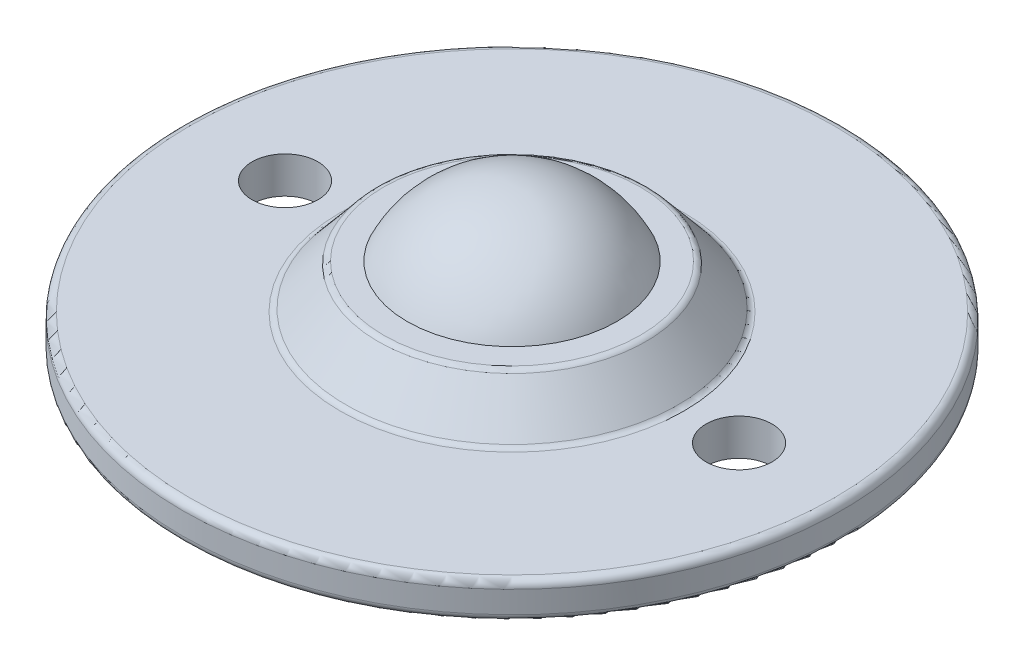
ISO-10303-21;
HEADER;
FILE_DESCRIPTION(('STEP AP214'),'2;1');
FILE_NAME('part.step','',(''),(''),'','','');
FILE_SCHEMA(('AUTOMOTIVE_DESIGN { 1 0 10303 214 1 1 1 1 }'));
ENDSEC;
DATA;
#1=APPLICATION_CONTEXT('core data for automotive mechanical design processes');
#2=APPLICATION_PROTOCOL_DEFINITION('international standard','automotive_design',2000,#1);
#3=PRODUCT_CONTEXT('',#1,'mechanical');
#4=PRODUCT('Part','Part','',(#3));
#5=PRODUCT_RELATED_PRODUCT_CATEGORY('part','',(#4));
#6=PRODUCT_DEFINITION_FORMATION('','',#4);
#7=PRODUCT_DEFINITION_CONTEXT('part definition',#1,'design');
#8=PRODUCT_DEFINITION('design','',#6,#7);
#9=PRODUCT_DEFINITION_SHAPE('','',#8);
#10=(LENGTH_UNIT() NAMED_UNIT(*) SI_UNIT(.MILLI.,.METRE.));
#11=(NAMED_UNIT(*) PLANE_ANGLE_UNIT() SI_UNIT($,.RADIAN.));
#12=(NAMED_UNIT(*) SI_UNIT($,.STERADIAN.) SOLID_ANGLE_UNIT());
#13=UNCERTAINTY_MEASURE_WITH_UNIT(LENGTH_MEASURE(1.E-05),#10,'distance_accuracy_value','');
#14=(GEOMETRIC_REPRESENTATION_CONTEXT(3) GLOBAL_UNCERTAINTY_ASSIGNED_CONTEXT((#13)) GLOBAL_UNIT_ASSIGNED_CONTEXT((#10,
#11,#12)) REPRESENTATION_CONTEXT('',''));
#15=CARTESIAN_POINT('',(0.,0.,0.));
#16=DIRECTION('',(0.,0.,1.));
#17=DIRECTION('',(1.,0.,0.));
#18=AXIS2_PLACEMENT_3D('',#15,#16,#17);
#19=CARTESIAN_POINT('',(0.,-1.00613961606655E-13,0.));
#20=DIRECTION('',(0.,1.,0.));
#21=DIRECTION('',(0.,0.,-1.));
#22=AXIS2_PLACEMENT_3D('',#19,#20,#21);
#23=SPHERICAL_SURFACE('',#22,7.93750000000009);
#24=CARTESIAN_POINT('',(0.,3.43750000000002,0.));
#25=DIRECTION('',(0.,1.,0.));
#26=DIRECTION('',(0.,0.,1.));
#27=AXIS2_PLACEMENT_3D('',#24,#25,#26);
#28=CIRCLE('',#27,7.15454401062705);
#29=CARTESIAN_POINT('',(0.,3.43750000000004,7.15454401062701));
#30=VERTEX_POINT('',#29);
#31=EDGE_CURVE('E63',#30,#30,#28,.T.);
#32=ORIENTED_EDGE('',*,*,#31,.T.);
#33=EDGE_LOOP('',(#32));
#34=FACE_BOUND('',#33,.T.);
#35=ADVANCED_FACE('F31',(#34),#23,.T.);
#36=CARTESIAN_POINT('',(0.,3.4375,-7.15454401062709));
#37=DIRECTION('',(0.,-1.,0.));
#38=DIRECTION('',(0.,0.,-1.));
#39=AXIS2_PLACEMENT_3D('',#36,#37,#38);
#40=PLANE('',#39);
#41=CARTESIAN_POINT('',(0.,3.43750000000002,0.));
#42=DIRECTION('',(0.,-1.,0.));
#43=DIRECTION('',(0.,0.,-1.));
#44=AXIS2_PLACEMENT_3D('',#41,#42,#43);
#45=CIRCLE('',#44,8.76581252700774);
#46=CARTESIAN_POINT('',(0.,3.4375,-8.76581252700778));
#47=VERTEX_POINT('',#46);
#48=EDGE_CURVE('E60',#47,#47,#45,.F.);
#49=ORIENTED_EDGE('',*,*,#48,.T.);
#50=EDGE_LOOP('',(#49));
#51=FACE_BOUND('',#50,.T.);
#52=ORIENTED_EDGE('',*,*,#31,.F.);
#53=EDGE_LOOP('',(#52));
#54=FACE_BOUND('',#53,.T.);
#55=ADVANCED_FACE('F121',(#51,#54),#40,.F.);
#56=CARTESIAN_POINT('',(0.,0.437500000000029,0.));
#57=DIRECTION('',(0.,-1.,0.));
#58=DIRECTION('',(0.,0.,-1.));
#59=AXIS2_PLACEMENT_3D('',#56,#57,#58);
#60=CONICAL_SURFACE('',#59,11.5,0.694738276196706);
#61=CARTESIAN_POINT('',(0.,3.25759219983226,0.));
#62=DIRECTION('',(0.,1.,0.));
#63=DIRECTION('',(0.,0.,1.));
#64=AXIS2_PLACEMENT_3D('',#61,#62,#63);
#65=CIRCLE('',#64,9.14992316680643);
#66=CARTESIAN_POINT('',(0.,3.25759219983229,9.14992316680638));
#67=VERTEX_POINT('',#66);
#68=EDGE_CURVE('E54',#67,#67,#65,.F.);
#69=ORIENTED_EDGE('',*,*,#68,.T.);
#70=EDGE_LOOP('',(#69));
#71=FACE_BOUND('',#70,.T.);
#72=CARTESIAN_POINT('',(0.,0.617407800167804,0.));
#73=DIRECTION('',(0.,-1.,0.));
#74=DIRECTION('',(0.,0.,-1.));
#75=AXIS2_PLACEMENT_3D('',#72,#73,#74);
#76=CIRCLE('',#75,11.3500768331935);
#77=CARTESIAN_POINT('',(0.,0.617407800167774,-11.3500768331935));
#78=VERTEX_POINT('',#77);
#79=EDGE_CURVE('E57',#78,#78,#76,.F.);
#80=ORIENTED_EDGE('',*,*,#79,.T.);
#81=EDGE_LOOP('',(#80));
#82=FACE_BOUND('',#81,.T.);
#83=ADVANCED_FACE('F92',(#71,#82),#60,.T.);
#84=CARTESIAN_POINT('',(0.,0.437499999999985,-22.5));
#85=DIRECTION('',(0.,-1.,0.));
#86=DIRECTION('',(0.,0.,-1.));
#87=AXIS2_PLACEMENT_3D('',#84,#85,#86);
#88=PLANE('',#87);
#89=CARTESIAN_POINT('',(0.,0.437500000000044,0.));
#90=DIRECTION('',(0.,-1.,0.));
#91=DIRECTION('',(0.,0.,-1.));
#92=AXIS2_PLACEMENT_3D('',#89,#90,#91);
#93=CIRCLE('',#92,11.7341874729922);
#94=CARTESIAN_POINT('',(0.,0.437500000000013,-11.7341874729922));
#95=VERTEX_POINT('',#94);
#96=EDGE_CURVE('E46',#95,#95,#93,.T.);
#97=ORIENTED_EDGE('',*,*,#96,.T.);
#98=EDGE_LOOP('',(#97));
#99=FACE_BOUND('',#98,.T.);
#100=CARTESIAN_POINT('',(0.,0.437500000000044,0.));
#101=DIRECTION('',(0.,-1.,0.));
#102=DIRECTION('',(0.,0.,-1.));
#103=AXIS2_PLACEMENT_3D('',#100,#101,#102);
#104=CIRCLE('',#103,22.);
#105=CARTESIAN_POINT('',(0.,0.437499999999986,-22.));
#106=VERTEX_POINT('',#105);
#107=EDGE_CURVE('E51',#106,#106,#104,.F.);
#108=ORIENTED_EDGE('',*,*,#107,.T.);
#109=EDGE_LOOP('',(#108));
#110=FACE_BOUND('',#109,.T.);
#111=CARTESIAN_POINT('',(-15.5,0.437500000000044,0.));
#112=DIRECTION('',(0.,1.,0.));
#113=DIRECTION('',(0.,0.,1.));
#114=AXIS2_PLACEMENT_3D('',#111,#112,#113);
#115=CIRCLE('',#114,2.25);
#116=CARTESIAN_POINT('',(-15.5,0.43750000000005,2.25));
#117=VERTEX_POINT('',#116);
#118=EDGE_CURVE('E71',#117,#117,#115,.T.);
#119=ORIENTED_EDGE('',*,*,#118,.F.);
#120=EDGE_LOOP('',(#119));
#121=FACE_BOUND('',#120,.T.);
#122=CARTESIAN_POINT('',(15.5,0.437500000000044,0.));
#123=DIRECTION('',(0.,1.,0.));
#124=DIRECTION('',(0.,0.,1.));
#125=AXIS2_PLACEMENT_3D('',#122,#123,#124);
#126=CIRCLE('',#125,2.25);
#127=CARTESIAN_POINT('',(15.5,0.43750000000005,2.25));
#128=VERTEX_POINT('',#127);
#129=EDGE_CURVE('E79',#128,#128,#126,.T.);
#130=ORIENTED_EDGE('',*,*,#129,.F.);
#131=EDGE_LOOP('',(#130));
#132=FACE_BOUND('',#131,.T.);
#133=ADVANCED_FACE('F88',(#99,#110,#121,#132),#88,.F.);
#134=CARTESIAN_POINT('',(0.,7.93749999999999,0.));
#135=DIRECTION('',(0.,1.,0.));
#136=DIRECTION('',(0.,0.,1.));
#137=AXIS2_PLACEMENT_3D('',#134,#135,#136);
#138=CYLINDRICAL_SURFACE('',#137,22.5);
#139=CARTESIAN_POINT('',(0.,-1.56249999999995,0.));
#140=DIRECTION('',(0.,1.,0.));
#141=DIRECTION('',(0.,0.,1.));
#142=AXIS2_PLACEMENT_3D('',#139,#140,#141);
#143=CIRCLE('',#142,22.5);
#144=CARTESIAN_POINT('',(0.,-1.56249999999989,22.4999999999999));
#145=VERTEX_POINT('',#144);
#146=EDGE_CURVE('E38',#145,#145,#143,.T.);
#147=ORIENTED_EDGE('',*,*,#146,.T.);
#148=EDGE_LOOP('',(#147));
#149=FACE_BOUND('',#148,.T.);
#150=CARTESIAN_POINT('',(0.,-0.0624999999999567,0.));
#151=DIRECTION('',(0.,-1.,0.));
#152=DIRECTION('',(0.,0.,-1.));
#153=AXIS2_PLACEMENT_3D('',#150,#151,#152);
#154=CIRCLE('',#153,22.5);
#155=CARTESIAN_POINT('',(0.,-0.0625000000000162,-22.5));
#156=VERTEX_POINT('',#155);
#157=EDGE_CURVE('E42',#156,#156,#154,.T.);
#158=ORIENTED_EDGE('',*,*,#157,.T.);
#159=EDGE_LOOP('',(#158));
#160=FACE_BOUND('',#159,.T.);
#161=ADVANCED_FACE('F91',(#149,#160),#138,.T.);
#162=CARTESIAN_POINT('',(0.,-2.06249999999999,-13.));
#163=DIRECTION('',(0.,1.,0.));
#164=DIRECTION('',(0.,0.,1.));
#165=AXIS2_PLACEMENT_3D('',#162,#163,#164);
#166=PLANE('',#165);
#167=CARTESIAN_POINT('',(0.,-2.06249999999995,0.));
#168=DIRECTION('',(0.,1.,0.));
#169=DIRECTION('',(0.,0.,1.));
#170=AXIS2_PLACEMENT_3D('',#167,#168,#169);
#171=CIRCLE('',#170,22.);
#172=CARTESIAN_POINT('',(0.,-2.0624999999999,21.9999999999999));
#173=VERTEX_POINT('',#172);
#174=EDGE_CURVE('E10',#173,#173,#171,.F.);
#175=ORIENTED_EDGE('',*,*,#174,.T.);
#176=EDGE_LOOP('',(#175));
#177=FACE_BOUND('',#176,.T.);
#178=CARTESIAN_POINT('',(-15.5,-2.06249999999995,0.));
#179=DIRECTION('',(0.,1.,0.));
#180=DIRECTION('',(0.,0.,1.));
#181=AXIS2_PLACEMENT_3D('',#178,#179,#180);
#182=CIRCLE('',#181,2.25);
#183=CARTESIAN_POINT('',(-15.5,-2.06249999999995,2.25000000000001));
#184=VERTEX_POINT('',#183);
#185=EDGE_CURVE('E64',#184,#184,#182,.T.);
#186=ORIENTED_EDGE('',*,*,#185,.T.);
#187=EDGE_LOOP('',(#186));
#188=FACE_BOUND('',#187,.T.);
#189=CARTESIAN_POINT('',(15.5,-2.06249999999995,0.));
#190=DIRECTION('',(0.,1.,0.));
#191=DIRECTION('',(0.,0.,1.));
#192=AXIS2_PLACEMENT_3D('',#189,#190,#191);
#193=CIRCLE('',#192,2.25);
#194=CARTESIAN_POINT('',(15.5,-2.06249999999995,2.25));
#195=VERTEX_POINT('',#194);
#196=EDGE_CURVE('E68',#195,#195,#193,.T.);
#197=ORIENTED_EDGE('',*,*,#196,.T.);
#198=EDGE_LOOP('',(#197));
#199=FACE_BOUND('',#198,.T.);
#200=CARTESIAN_POINT('',(0.,-2.06249999999997,0.));
#201=DIRECTION('',(0.,1.,0.));
#202=DIRECTION('',(0.,0.,1.));
#203=AXIS2_PLACEMENT_3D('',#200,#201,#202);
#204=CIRCLE('',#203,13.);
#205=CARTESIAN_POINT('',(0.,-2.06249999999993,12.9999999999999));
#206=VERTEX_POINT('',#205);
#207=EDGE_CURVE('E74',#206,#206,#204,.T.);
#208=ORIENTED_EDGE('',*,*,#207,.T.);
#209=EDGE_LOOP('',(#208));
#210=FACE_BOUND('',#209,.T.);
#211=ADVANCED_FACE('F104',(#177,#188,#199,#210),#166,.F.);
#212=CARTESIAN_POINT('',(0.,-4.88888888888886,0.));
#213=DIRECTION('',(0.,1.,0.));
#214=DIRECTION('',(0.,0.,1.));
#215=AXIS2_PLACEMENT_3D('',#212,#213,#214);
#216=TOROIDAL_SURFACE('',#215,13.,2.82638888888889);
#217=ORIENTED_EDGE('',*,*,#207,.F.);
#218=EDGE_LOOP('',(#217));
#219=FACE_BOUND('',#218,.T.);
#220=CARTESIAN_POINT('',(0.,-3.89399999999996,0.));
#221=DIRECTION('',(0.,1.,0.));
#222=DIRECTION('',(0.,0.,1.));
#223=AXIS2_PLACEMENT_3D('',#220,#221,#222);
#224=CIRCLE('',#223,10.3544999999999);
#225=CARTESIAN_POINT('',(0.,-3.89399999999993,10.3544999999999));
#226=VERTEX_POINT('',#225);
#227=EDGE_CURVE('E67',#226,#226,#224,.T.);
#228=ORIENTED_EDGE('',*,*,#227,.T.);
#229=EDGE_LOOP('',(#228));
#230=FACE_BOUND('',#229,.T.);
#231=ADVANCED_FACE('F107',(#219,#230),#216,.F.);
#232=CARTESIAN_POINT('',(0.,-1.00613961606655E-13,0.));
#233=DIRECTION('',(0.,1.,0.));
#234=DIRECTION('',(0.,0.,-1.));
#235=AXIS2_PLACEMENT_3D('',#232,#233,#234);
#236=SPHERICAL_SURFACE('',#235,11.0625);
#237=ORIENTED_EDGE('',*,*,#227,.F.);
#238=EDGE_LOOP('',(#237));
#239=FACE_BOUND('',#238,.T.);
#240=ADVANCED_FACE('F100',(#239),#236,.T.);
#241=CARTESIAN_POINT('',(15.5,-11.0625000000001,0.));
#242=DIRECTION('',(0.,1.,0.));
#243=DIRECTION('',(0.,0.,1.));
#244=AXIS2_PLACEMENT_3D('',#241,#242,#243);
#245=CYLINDRICAL_SURFACE('',#244,2.25);
#246=ORIENTED_EDGE('',*,*,#129,.T.);
#247=EDGE_LOOP('',(#246));
#248=FACE_BOUND('',#247,.T.);
#249=ORIENTED_EDGE('',*,*,#196,.F.);
#250=EDGE_LOOP('',(#249));
#251=FACE_BOUND('',#250,.T.);
#252=ADVANCED_FACE('F97',(#248,#251),#245,.F.);
#253=CARTESIAN_POINT('',(-15.5,-11.0625000000001,0.));
#254=DIRECTION('',(0.,1.,0.));
#255=DIRECTION('',(0.,0.,1.));
#256=AXIS2_PLACEMENT_3D('',#253,#254,#255);
#257=CYLINDRICAL_SURFACE('',#256,2.25);
#258=ORIENTED_EDGE('',*,*,#118,.T.);
#259=EDGE_LOOP('',(#258));
#260=FACE_BOUND('',#259,.T.);
#261=ORIENTED_EDGE('',*,*,#185,.F.);
#262=EDGE_LOOP('',(#261));
#263=FACE_BOUND('',#262,.T.);
#264=ADVANCED_FACE('F85',(#260,#263),#257,.F.);
#265=CARTESIAN_POINT('',(0.,2.93750000000002,0.));
#266=DIRECTION('',(0.,-1.,0.));
#267=DIRECTION('',(0.,0.,-1.));
#268=AXIS2_PLACEMENT_3D('',#265,#266,#267);
#269=TOROIDAL_SURFACE('',#268,8.76581252700774,0.5);
#270=ORIENTED_EDGE('',*,*,#68,.F.);
#271=EDGE_LOOP('',(#270));
#272=FACE_BOUND('',#271,.T.);
#273=ORIENTED_EDGE('',*,*,#48,.F.);
#274=EDGE_LOOP('',(#273));
#275=FACE_BOUND('',#274,.T.);
#276=ADVANCED_FACE('F131',(#272,#275),#269,.T.);
#277=CARTESIAN_POINT('',(0.,0.937500000000044,0.));
#278=DIRECTION('',(0.,-1.,0.));
#279=DIRECTION('',(0.,0.,-1.));
#280=AXIS2_PLACEMENT_3D('',#277,#278,#279);
#281=TOROIDAL_SURFACE('',#280,11.7341874729922,0.5);
#282=ORIENTED_EDGE('',*,*,#96,.F.);
#283=EDGE_LOOP('',(#282));
#284=FACE_BOUND('',#283,.T.);
#285=ORIENTED_EDGE('',*,*,#79,.F.);
#286=EDGE_LOOP('',(#285));
#287=FACE_BOUND('',#286,.T.);
#288=ADVANCED_FACE('F134',(#284,#287),#281,.F.);
#289=CARTESIAN_POINT('',(0.,-1.56249999999995,0.));
#290=DIRECTION('',(0.,1.,0.));
#291=DIRECTION('',(0.,0.,1.));
#292=AXIS2_PLACEMENT_3D('',#289,#290,#291);
#293=TOROIDAL_SURFACE('',#292,22.,0.5);
#294=ORIENTED_EDGE('',*,*,#174,.F.);
#295=EDGE_LOOP('',(#294));
#296=FACE_BOUND('',#295,.T.);
#297=ORIENTED_EDGE('',*,*,#146,.F.);
#298=EDGE_LOOP('',(#297));
#299=FACE_BOUND('',#298,.T.);
#300=ADVANCED_FACE('F137',(#296,#299),#293,.T.);
#301=CARTESIAN_POINT('',(0.,-0.0624999999999567,0.));
#302=DIRECTION('',(0.,-1.,0.));
#303=DIRECTION('',(0.,0.,-1.));
#304=AXIS2_PLACEMENT_3D('',#301,#302,#303);
#305=TOROIDAL_SURFACE('',#304,22.,0.5);
#306=ORIENTED_EDGE('',*,*,#157,.F.);
#307=EDGE_LOOP('',(#306));
#308=FACE_BOUND('',#307,.T.);
#309=ORIENTED_EDGE('',*,*,#107,.F.);
#310=EDGE_LOOP('',(#309));
#311=FACE_BOUND('',#310,.T.);
#312=ADVANCED_FACE('F33',(#308,#311),#305,.T.);
#313=CLOSED_SHELL('',(#35,#55,#83,#133,#161,#211,#231,#240,#252,#264,#276,#288,#300,#312));
#314=MANIFOLD_SOLID_BREP('B2',#313);
#315=ADVANCED_BREP_SHAPE_REPRESENTATION('',(#18,#314),#14);
#316=SHAPE_DEFINITION_REPRESENTATION(#9,#315);
ENDSEC;
END-ISO-10303-21;
